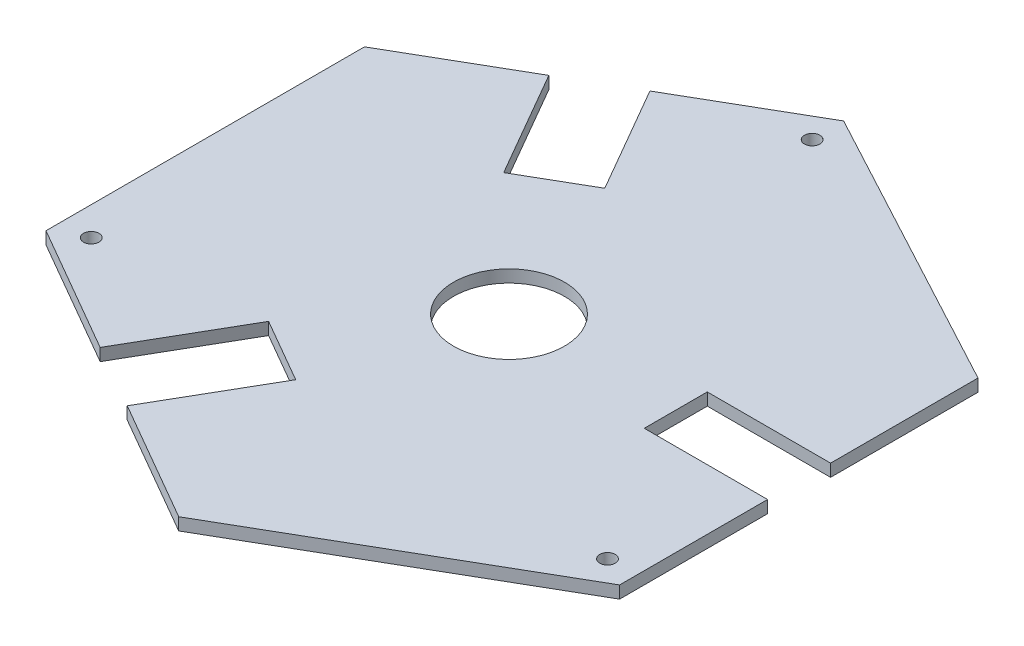
ISO-10303-21;
HEADER;
FILE_DESCRIPTION(('STEP AP214'),'2;1');
FILE_NAME('part.step','',(''),(''),'','','');
FILE_SCHEMA(('AUTOMOTIVE_DESIGN { 1 0 10303 214 1 1 1 1 }'));
ENDSEC;
DATA;
#1=APPLICATION_CONTEXT('core data for automotive mechanical design processes');
#2=APPLICATION_PROTOCOL_DEFINITION('international standard','automotive_design',2000,#1);
#3=PRODUCT_CONTEXT('',#1,'mechanical');
#4=PRODUCT('Part','Part','',(#3));
#5=PRODUCT_RELATED_PRODUCT_CATEGORY('part','',(#4));
#6=PRODUCT_DEFINITION_FORMATION('','',#4);
#7=PRODUCT_DEFINITION_CONTEXT('part definition',#1,'design');
#8=PRODUCT_DEFINITION('design','',#6,#7);
#9=PRODUCT_DEFINITION_SHAPE('','',#8);
#10=(LENGTH_UNIT() NAMED_UNIT(*) SI_UNIT(.MILLI.,.METRE.));
#11=(NAMED_UNIT(*) PLANE_ANGLE_UNIT() SI_UNIT($,.RADIAN.));
#12=(NAMED_UNIT(*) SI_UNIT($,.STERADIAN.) SOLID_ANGLE_UNIT());
#13=UNCERTAINTY_MEASURE_WITH_UNIT(LENGTH_MEASURE(1.E-05),#10,'distance_accuracy_value','');
#14=(GEOMETRIC_REPRESENTATION_CONTEXT(3) GLOBAL_UNCERTAINTY_ASSIGNED_CONTEXT((#13)) GLOBAL_UNIT_ASSIGNED_CONTEXT((#10,
#11,#12)) REPRESENTATION_CONTEXT('',''));
#15=CARTESIAN_POINT('',(0.,0.,0.));
#16=DIRECTION('',(0.,0.,1.));
#17=DIRECTION('',(1.,0.,0.));
#18=AXIS2_PLACEMENT_3D('',#15,#16,#17);
#19=CARTESIAN_POINT('',(0.,17.5,0.));
#20=DIRECTION('',(0.,-1.,0.));
#21=DIRECTION('',(0.,0.,-1.));
#22=AXIS2_PLACEMENT_3D('',#19,#20,#21);
#23=CYLINDRICAL_SURFACE('',#22,9.);
#24=CARTESIAN_POINT('',(0.,17.5,0.));
#25=DIRECTION('',(0.,1.,0.));
#26=DIRECTION('',(0.,0.,1.));
#27=AXIS2_PLACEMENT_3D('',#24,#25,#26);
#28=CIRCLE('',#27,9.);
#29=CARTESIAN_POINT('',(0.,17.5,9.));
#30=VERTEX_POINT('',#29);
#31=EDGE_CURVE('E362',#30,#30,#28,.T.);
#32=ORIENTED_EDGE('',*,*,#31,.T.);
#33=EDGE_LOOP('',(#32));
#34=FACE_BOUND('',#33,.T.);
#35=CARTESIAN_POINT('',(0.,15.5,0.));
#36=DIRECTION('',(0.,1.,0.));
#37=DIRECTION('',(0.,0.,1.));
#38=AXIS2_PLACEMENT_3D('',#35,#36,#37);
#39=CIRCLE('',#38,9.);
#40=CARTESIAN_POINT('',(0.,15.5,9.));
#41=VERTEX_POINT('',#40);
#42=EDGE_CURVE('E363',#41,#41,#39,.T.);
#43=ORIENTED_EDGE('',*,*,#42,.F.);
#44=EDGE_LOOP('',(#43));
#45=FACE_BOUND('',#44,.T.);
#46=ADVANCED_FACE('F41',(#34,#45),#23,.F.);
#47=CARTESIAN_POINT('',(0.0668776199884268,7.,-49.0942904802489));
#48=DIRECTION('',(0.,1.,0.));
#49=DIRECTION('',(0.,0.,1.));
#50=AXIS2_PLACEMENT_3D('',#47,#48,#49);
#51=CYLINDRICAL_SURFACE('',#50,1.25);
#52=CARTESIAN_POINT('',(0.0668776199884268,15.5,-49.0942904802489));
#53=DIRECTION('',(0.,1.,0.));
#54=DIRECTION('',(0.,0.,1.));
#55=AXIS2_PLACEMENT_3D('',#52,#53,#54);
#56=CIRCLE('',#55,1.25);
#57=CARTESIAN_POINT('',(0.0668776199884268,15.5,-47.8442904802489));
#58=VERTEX_POINT('',#57);
#59=EDGE_CURVE('E367',#58,#58,#56,.F.);
#60=ORIENTED_EDGE('',*,*,#59,.T.);
#61=EDGE_LOOP('',(#60));
#62=FACE_BOUND('',#61,.T.);
#63=CARTESIAN_POINT('',(0.0668776199884268,17.5,-49.0942904802489));
#64=DIRECTION('',(0.,1.,0.));
#65=DIRECTION('',(0.,0.,1.));
#66=AXIS2_PLACEMENT_3D('',#63,#64,#65);
#67=CIRCLE('',#66,1.25);
#68=CARTESIAN_POINT('',(0.0668776199884268,17.5,-47.8442904802489));
#69=VERTEX_POINT('',#68);
#70=EDGE_CURVE('E354',#69,#69,#67,.T.);
#71=ORIENTED_EDGE('',*,*,#70,.T.);
#72=EDGE_LOOP('',(#71));
#73=FACE_BOUND('',#72,.T.);
#74=ADVANCED_FACE('F418',(#62,#73),#51,.F.);
#75=CARTESIAN_POINT('',(-44.6151657788661,7.,23.1407684282072));
#76=DIRECTION('',(0.,1.,0.));
#77=DIRECTION('',(0.,0.,1.));
#78=AXIS2_PLACEMENT_3D('',#75,#76,#77);
#79=CYLINDRICAL_SURFACE('',#78,1.25);
#80=CARTESIAN_POINT('',(-44.6151657788661,15.5,23.1407684282072));
#81=DIRECTION('',(0.,1.,0.));
#82=DIRECTION('',(0.,0.,1.));
#83=AXIS2_PLACEMENT_3D('',#80,#81,#82);
#84=CIRCLE('',#83,1.25);
#85=CARTESIAN_POINT('',(-44.6151657788661,15.5,24.3907684282072));
#86=VERTEX_POINT('',#85);
#87=EDGE_CURVE('E378',#86,#86,#84,.F.);
#88=ORIENTED_EDGE('',*,*,#87,.T.);
#89=EDGE_LOOP('',(#88));
#90=FACE_BOUND('',#89,.T.);
#91=CARTESIAN_POINT('',(-44.6151657788661,17.5,23.1407684282072));
#92=DIRECTION('',(0.,1.,0.));
#93=DIRECTION('',(0.,0.,1.));
#94=AXIS2_PLACEMENT_3D('',#91,#92,#93);
#95=CIRCLE('',#94,1.25);
#96=CARTESIAN_POINT('',(-44.6151657788661,17.5,24.3907684282072));
#97=VERTEX_POINT('',#96);
#98=EDGE_CURVE('E297',#97,#97,#95,.T.);
#99=ORIENTED_EDGE('',*,*,#98,.T.);
#100=EDGE_LOOP('',(#99));
#101=FACE_BOUND('',#100,.T.);
#102=ADVANCED_FACE('F424',(#90,#101),#79,.F.);
#103=CARTESIAN_POINT('',(42.3480762113532,7.,26.3767752449313));
#104=DIRECTION('',(0.,1.,0.));
#105=DIRECTION('',(0.,0.,1.));
#106=AXIS2_PLACEMENT_3D('',#103,#104,#105);
#107=CYLINDRICAL_SURFACE('',#106,1.25);
#108=CARTESIAN_POINT('',(42.3480762113532,15.5,26.3767752449313));
#109=DIRECTION('',(0.,1.,0.));
#110=DIRECTION('',(0.,0.,1.));
#111=AXIS2_PLACEMENT_3D('',#108,#109,#110);
#112=CIRCLE('',#111,1.25);
#113=CARTESIAN_POINT('',(42.3480762113532,15.5,27.6267752449313));
#114=VERTEX_POINT('',#113);
#115=EDGE_CURVE('E374',#114,#114,#112,.F.);
#116=ORIENTED_EDGE('',*,*,#115,.T.);
#117=EDGE_LOOP('',(#116));
#118=FACE_BOUND('',#117,.T.);
#119=CARTESIAN_POINT('',(42.3480762113532,17.5,26.3767752449313));
#120=DIRECTION('',(0.,1.,0.));
#121=DIRECTION('',(0.,0.,1.));
#122=AXIS2_PLACEMENT_3D('',#119,#120,#121);
#123=CIRCLE('',#122,1.25);
#124=CARTESIAN_POINT('',(42.3480762113532,17.5,27.6267752449313));
#125=VERTEX_POINT('',#124);
#126=EDGE_CURVE('E358',#125,#125,#123,.T.);
#127=ORIENTED_EDGE('',*,*,#126,.T.);
#128=EDGE_LOOP('',(#127));
#129=FACE_BOUND('',#128,.T.);
#130=ADVANCED_FACE('F431',(#118,#129),#107,.F.);
#131=CARTESIAN_POINT('',(0.,17.5,0.));
#132=DIRECTION('',(0.,1.,0.));
#133=DIRECTION('',(0.,0.,1.));
#134=AXIS2_PLACEMENT_3D('',#131,#132,#133);
#135=PLANE('',#134);
#136=ORIENTED_EDGE('',*,*,#126,.F.);
#137=EDGE_LOOP('',(#136));
#138=FACE_BOUND('',#137,.T.);
#139=ORIENTED_EDGE('',*,*,#98,.F.);
#140=EDGE_LOOP('',(#139));
#141=FACE_BOUND('',#140,.T.);
#142=DIRECTION('',(0.866025403784439,0.,0.5));
#143=VECTOR('',#142,1.);
#144=CARTESIAN_POINT('',(-28.4824798766863,17.5,37.8265578798319));
#145=LINE('',#144,#143);
#146=CARTESIAN_POINT('',(-49.2670895675128,17.5,25.8265578798319));
#147=VERTEX_POINT('',#146);
#148=CARTESIAN_POINT('',(-28.4824798766863,17.5,37.8265578798319));
#149=VERTEX_POINT('',#148);
#150=EDGE_CURVE('E195',#147,#149,#145,.T.);
#151=ORIENTED_EDGE('',*,*,#150,.T.);
#152=DIRECTION('',(0.5,0.,-0.866025403784439));
#153=VECTOR('',#152,1.);
#154=CARTESIAN_POINT('',(-28.4824798766863,17.5,37.8265578798319));
#155=LINE('',#154,#153);
#156=CARTESIAN_POINT('',(-18.4824798766869,17.5,20.5060498041443));
#157=VERTEX_POINT('',#156);
#158=EDGE_CURVE('E346',#149,#157,#155,.T.);
#159=ORIENTED_EDGE('',*,*,#158,.T.);
#160=DIRECTION('',(0.866025403784439,0.,0.5));
#161=VECTOR('',#160,1.);
#162=CARTESIAN_POINT('',(-18.4824798766869,17.5,20.5060498041443));
#163=LINE('',#162,#161);
#164=CARTESIAN_POINT('',(-8.09017503127363,17.5,26.5060498041443));
#165=VERTEX_POINT('',#164);
#166=EDGE_CURVE('E343',#157,#165,#163,.T.);
#167=ORIENTED_EDGE('',*,*,#166,.T.);
#168=DIRECTION('',(-0.5,0.,0.866025403784439));
#169=VECTOR('',#168,1.);
#170=CARTESIAN_POINT('',(-8.09017503127363,17.5,26.5060498041443));
#171=LINE('',#170,#169);
#172=CARTESIAN_POINT('',(-18.090175031273,17.5,43.8265578798319));
#173=VERTEX_POINT('',#172);
#174=EDGE_CURVE('E340',#165,#173,#171,.T.);
#175=ORIENTED_EDGE('',*,*,#174,.T.);
#176=DIRECTION('',(0.866025403784439,0.,0.5));
#177=VECTOR('',#176,1.);
#178=CARTESIAN_POINT('',(-18.090175031273,17.5,43.8265578798319));
#179=LINE('',#178,#177);
#180=CARTESIAN_POINT('',(1.66891932634631,17.5,55.2344763261467));
#181=VERTEX_POINT('',#180);
#182=EDGE_CURVE('E337',#173,#181,#179,.T.);
#183=ORIENTED_EDGE('',*,*,#182,.T.);
#184=DIRECTION('',(0.866025403784438,0.,-0.5));
#185=VECTOR('',#184,1.);
#186=CARTESIAN_POINT('',(1.66891932634631,17.5,55.2344763261467));
#187=LINE('',#186,#185);
#188=CARTESIAN_POINT('',(47.,17.5,29.0625646965561));
#189=VERTEX_POINT('',#188);
#190=EDGE_CURVE('E334',#181,#189,#187,.T.);
#191=ORIENTED_EDGE('',*,*,#190,.T.);
#192=DIRECTION('',(0.,0.,-1.));
#193=VECTOR('',#192,1.);
#194=CARTESIAN_POINT('',(47.,17.5,5.06256469655606));
#195=LINE('',#194,#193);
#196=CARTESIAN_POINT('',(47.,17.5,5.06256469655606));
#197=VERTEX_POINT('',#196);
#198=EDGE_CURVE('E331',#189,#197,#195,.T.);
#199=ORIENTED_EDGE('',*,*,#198,.T.);
#200=DIRECTION('',(-1.,0.,0.));
#201=VECTOR('',#200,1.);
#202=CARTESIAN_POINT('',(26.9999999999999,17.5,5.06256469655606));
#203=LINE('',#202,#201);
#204=CARTESIAN_POINT('',(26.9999999999999,17.5,5.06256469655606));
#205=VERTEX_POINT('',#204);
#206=EDGE_CURVE('E328',#197,#205,#203,.T.);
#207=ORIENTED_EDGE('',*,*,#206,.T.);
#208=DIRECTION('',(0.,0.,-1.));
#209=VECTOR('',#208,1.);
#210=CARTESIAN_POINT('',(26.9999999999999,17.5,5.06256469655606));
#211=LINE('',#210,#209);
#212=CARTESIAN_POINT('',(26.9999999999999,17.5,-5.15470053837906));
#213=VERTEX_POINT('',#212);
#214=EDGE_CURVE('E325',#205,#213,#211,.T.);
#215=ORIENTED_EDGE('',*,*,#214,.T.);
#216=DIRECTION('',(1.,0.,0.));
#217=VECTOR('',#216,1.);
#218=CARTESIAN_POINT('',(26.9999999999999,17.5,-5.15470053837906));
#219=LINE('',#218,#217);
#220=CARTESIAN_POINT('',(47.,17.5,-5.15470053837906));
#221=VERTEX_POINT('',#220);
#222=EDGE_CURVE('E322',#213,#221,#219,.T.);
#223=ORIENTED_EDGE('',*,*,#222,.T.);
#224=DIRECTION('',(0.,0.,-1.));
#225=VECTOR('',#224,1.);
#226=CARTESIAN_POINT('',(47.,17.5,-5.15470053837906));
#227=LINE('',#226,#225);
#228=CARTESIAN_POINT('',(47.,17.5,-29.0625646965558));
#229=VERTEX_POINT('',#228);
#230=EDGE_CURVE('E319',#221,#229,#227,.T.);
#231=ORIENTED_EDGE('',*,*,#230,.T.);
#232=DIRECTION('',(-0.8812473665794,0.,-0.472655348956164));
#233=VECTOR('',#232,1.);
#234=CARTESIAN_POINT('',(47.,17.5,-29.0625646965558));
#235=LINE('',#234,#233);
#236=CARTESIAN_POINT('',(0.,17.5,-54.2709253038248));
#237=VERTEX_POINT('',#236);
#238=EDGE_CURVE('E316',#229,#237,#235,.T.);
#239=ORIENTED_EDGE('',*,*,#238,.T.);
#240=DIRECTION('',(-0.866025403784439,0.,0.5));
#241=VECTOR('',#240,1.);
#242=CARTESIAN_POINT('',(0.,17.5,-54.2709253038248));
#243=LINE('',#242,#241);
#244=CARTESIAN_POINT('',(-19.9185842870421,17.5,-42.7709253038248));
#245=VERTEX_POINT('',#244);
#246=EDGE_CURVE('E313',#237,#245,#243,.T.);
#247=ORIENTED_EDGE('',*,*,#246,.T.);
#248=DIRECTION('',(0.500000000000001,0.,0.866025403784438));
#249=VECTOR('',#248,1.);
#250=CARTESIAN_POINT('',(-19.9185842870421,17.5,-42.7709253038248));
#251=LINE('',#250,#249);
#252=CARTESIAN_POINT('',(-9.91858428704279,17.5,-25.4504172281373));
#253=VERTEX_POINT('',#252);
#254=EDGE_CURVE('E310',#245,#253,#251,.T.);
#255=ORIENTED_EDGE('',*,*,#254,.T.);
#256=DIRECTION('',(-0.866025403784439,0.,0.5));
#257=VECTOR('',#256,1.);
#258=CARTESIAN_POINT('',(-9.91858428704279,17.5,-25.4504172281373));
#259=LINE('',#258,#257);
#260=CARTESIAN_POINT('',(-20.3108891324561,17.5,-19.4504172281373));
#261=VERTEX_POINT('',#260);
#262=EDGE_CURVE('E307',#253,#261,#259,.T.);
#263=ORIENTED_EDGE('',*,*,#262,.T.);
#264=DIRECTION('',(-0.5,0.,-0.866025403784439));
#265=VECTOR('',#264,1.);
#266=CARTESIAN_POINT('',(-20.3108891324561,17.5,-19.4504172281373));
#267=LINE('',#266,#265);
#268=CARTESIAN_POINT('',(-30.3108891324553,17.5,-36.7709253038248));
#269=VERTEX_POINT('',#268);
#270=EDGE_CURVE('E304',#261,#269,#267,.T.);
#271=ORIENTED_EDGE('',*,*,#270,.T.);
#272=DIRECTION('',(-0.866025403784439,0.,0.5));
#273=VECTOR('',#272,1.);
#274=CARTESIAN_POINT('',(-30.3108891324553,17.5,-36.7709253038248));
#275=LINE('',#274,#273);
#276=CARTESIAN_POINT('',(-49.2670895675128,17.5,-25.8265578798319));
#277=VERTEX_POINT('',#276);
#278=EDGE_CURVE('E300',#269,#277,#275,.T.);
#279=ORIENTED_EDGE('',*,*,#278,.T.);
#280=DIRECTION('',(0.,0.,1.));
#281=VECTOR('',#280,1.);
#282=CARTESIAN_POINT('',(-49.2670895675128,17.5,-25.8265578798319));
#283=LINE('',#282,#281);
#284=EDGE_CURVE('E271',#277,#147,#283,.T.);
#285=ORIENTED_EDGE('',*,*,#284,.T.);
#286=EDGE_LOOP('',(#151,#159,#167,#175,#183,#191,#199,#207,#215,#223,#231,#239,#247,#255,#263,
#271,#279,#285));
#287=FACE_BOUND('',#286,.T.);
#288=ORIENTED_EDGE('',*,*,#70,.F.);
#289=EDGE_LOOP('',(#288));
#290=FACE_BOUND('',#289,.T.);
#291=ORIENTED_EDGE('',*,*,#31,.F.);
#292=EDGE_LOOP('',(#291));
#293=FACE_BOUND('',#292,.T.);
#294=ADVANCED_FACE('F401',(#138,#141,#287,#290,#293),#135,.T.);
#295=CARTESIAN_POINT('',(-49.2670895675128,-4.5,-23.5171568030734));
#296=DIRECTION('',(1.,0.,0.));
#297=DIRECTION('',(0.,0.,-1.));
#298=AXIS2_PLACEMENT_3D('',#295,#296,#297);
#299=PLANE('',#298);
#300=DIRECTION('',(0.,1.,0.));
#301=VECTOR('',#300,1.);
#302=CARTESIAN_POINT('',(-49.2670895675128,-4.5,-25.8265578798319));
#303=LINE('',#302,#301);
#304=CARTESIAN_POINT('',(-49.2670895675128,15.5,-25.8265578798319));
#305=VERTEX_POINT('',#304);
#306=EDGE_CURVE('E188',#305,#277,#303,.T.);
#307=ORIENTED_EDGE('',*,*,#306,.F.);
#308=DIRECTION('',(0.,0.,-1.));
#309=VECTOR('',#308,1.);
#310=CARTESIAN_POINT('',(-49.2670895675128,15.5,-25.8265578798319));
#311=LINE('',#310,#309);
#312=CARTESIAN_POINT('',(-49.2670895675128,15.5,25.8265578798319));
#313=VERTEX_POINT('',#312);
#314=EDGE_CURVE('E172',#313,#305,#311,.T.);
#315=ORIENTED_EDGE('',*,*,#314,.F.);
#316=DIRECTION('',(0.,1.,0.));
#317=VECTOR('',#316,1.);
#318=CARTESIAN_POINT('',(-49.2670895675128,-4.5,25.8265578798319));
#319=LINE('',#318,#317);
#320=EDGE_CURVE('E51',#313,#147,#319,.T.);
#321=ORIENTED_EDGE('',*,*,#320,.T.);
#322=ORIENTED_EDGE('',*,*,#284,.F.);
#323=EDGE_LOOP('',(#307,#315,#321,#322));
#324=FACE_BOUND('',#323,.T.);
#325=ADVANCED_FACE('F185',(#324),#299,.F.);
#326=CARTESIAN_POINT('',(47.,17.5,-29.0625646965558));
#327=DIRECTION('',(-0.472655348956164,0.,0.8812473665794));
#328=DIRECTION('',(0.8812473665794,0.,0.472655348956164));
#329=AXIS2_PLACEMENT_3D('',#326,#327,#328);
#330=PLANE('',#329);
#331=DIRECTION('',(-0.8812473665794,0.,-0.472655348956164));
#332=VECTOR('',#331,1.);
#333=CARTESIAN_POINT('',(47.,15.5,-29.0625646965558));
#334=LINE('',#333,#332);
#335=CARTESIAN_POINT('',(47.,15.5,-29.0625646965558));
#336=VERTEX_POINT('',#335);
#337=CARTESIAN_POINT('',(0.,15.5,-54.2709253038248));
#338=VERTEX_POINT('',#337);
#339=EDGE_CURVE('E11',#336,#338,#334,.T.);
#340=ORIENTED_EDGE('',*,*,#339,.T.);
#341=DIRECTION('',(0.,-1.,0.));
#342=VECTOR('',#341,1.);
#343=CARTESIAN_POINT('',(0.,17.5,-54.2709253038248));
#344=LINE('',#343,#342);
#345=EDGE_CURVE('E252',#237,#338,#344,.T.);
#346=ORIENTED_EDGE('',*,*,#345,.F.);
#347=ORIENTED_EDGE('',*,*,#238,.F.);
#348=DIRECTION('',(0.,-1.,0.));
#349=VECTOR('',#348,1.);
#350=CARTESIAN_POINT('',(47.,17.5,-29.0625646965558));
#351=LINE('',#350,#349);
#352=EDGE_CURVE('E249',#229,#336,#351,.T.);
#353=ORIENTED_EDGE('',*,*,#352,.T.);
#354=EDGE_LOOP('',(#340,#346,#347,#353));
#355=FACE_BOUND('',#354,.T.);
#356=ADVANCED_FACE('F438',(#355),#330,.F.);
#357=CARTESIAN_POINT('',(-20.3108891324561,17.5,-19.4504172281373));
#358=DIRECTION('',(-0.866025403784439,0.,0.5));
#359=DIRECTION('',(0.5,0.,0.866025403784439));
#360=AXIS2_PLACEMENT_3D('',#357,#358,#359);
#361=PLANE('',#360);
#362=DIRECTION('',(-0.5,0.,-0.866025403784439));
#363=VECTOR('',#362,1.);
#364=CARTESIAN_POINT('',(-20.3108891324561,15.5,-19.4504172281373));
#365=LINE('',#364,#363);
#366=CARTESIAN_POINT('',(-20.3108891324561,15.5,-19.4504172281373));
#367=VERTEX_POINT('',#366);
#368=CARTESIAN_POINT('',(-30.3108891324554,15.5,-36.7709253038248));
#369=VERTEX_POINT('',#368);
#370=EDGE_CURVE('E65',#367,#369,#365,.T.);
#371=ORIENTED_EDGE('',*,*,#370,.T.);
#372=DIRECTION('',(0.,-1.,0.));
#373=VECTOR('',#372,1.);
#374=CARTESIAN_POINT('',(-30.3108891324553,17.5,-36.7709253038248));
#375=LINE('',#374,#373);
#376=EDGE_CURVE('E267',#269,#369,#375,.T.);
#377=ORIENTED_EDGE('',*,*,#376,.F.);
#378=ORIENTED_EDGE('',*,*,#270,.F.);
#379=DIRECTION('',(0.,-1.,0.));
#380=VECTOR('',#379,1.);
#381=CARTESIAN_POINT('',(-20.3108891324561,17.5,-19.4504172281373));
#382=LINE('',#381,#380);
#383=EDGE_CURVE('E264',#261,#367,#382,.T.);
#384=ORIENTED_EDGE('',*,*,#383,.T.);
#385=EDGE_LOOP('',(#371,#377,#378,#384));
#386=FACE_BOUND('',#385,.T.);
#387=ADVANCED_FACE('F435',(#386),#361,.F.);
#388=CARTESIAN_POINT('',(0.,15.5,0.));
#389=DIRECTION('',(0.,1.,0.));
#390=DIRECTION('',(0.,0.,1.));
#391=AXIS2_PLACEMENT_3D('',#388,#389,#390);
#392=PLANE('',#391);
#393=DIRECTION('',(0.866025403784439,0.,-0.5));
#394=VECTOR('',#393,1.);
#395=CARTESIAN_POINT('',(0.,15.5,-54.2709253038248));
#396=LINE('',#395,#394);
#397=EDGE_CURVE('E389',#305,#369,#396,.T.);
#398=ORIENTED_EDGE('',*,*,#397,.T.);
#399=ORIENTED_EDGE('',*,*,#370,.F.);
#400=DIRECTION('',(-0.866025403784439,0.,0.5));
#401=VECTOR('',#400,1.);
#402=CARTESIAN_POINT('',(-9.91858428704279,15.5,-25.4504172281373));
#403=LINE('',#402,#401);
#404=CARTESIAN_POINT('',(-9.91858428704279,15.5,-25.4504172281373));
#405=VERTEX_POINT('',#404);
#406=EDGE_CURVE('E274',#405,#367,#403,.T.);
#407=ORIENTED_EDGE('',*,*,#406,.F.);
#408=DIRECTION('',(0.500000000000001,0.,0.866025403784438));
#409=VECTOR('',#408,1.);
#410=CARTESIAN_POINT('',(-19.9185842870421,15.5,-42.7709253038248));
#411=LINE('',#410,#409);
#412=CARTESIAN_POINT('',(-19.9185842870421,15.5,-42.7709253038248));
#413=VERTEX_POINT('',#412);
#414=EDGE_CURVE('E277',#413,#405,#411,.T.);
#415=ORIENTED_EDGE('',*,*,#414,.F.);
#416=EDGE_CURVE('E190',#413,#338,#396,.T.);
#417=ORIENTED_EDGE('',*,*,#416,.T.);
#418=ORIENTED_EDGE('',*,*,#339,.F.);
#419=DIRECTION('',(0.,0.,1.));
#420=VECTOR('',#419,1.);
#421=CARTESIAN_POINT('',(47.,15.5,29.0625646965561));
#422=LINE('',#421,#420);
#423=CARTESIAN_POINT('',(47.,15.5,-5.15470053837906));
#424=VERTEX_POINT('',#423);
#425=EDGE_CURVE('E385',#336,#424,#422,.T.);
#426=ORIENTED_EDGE('',*,*,#425,.T.);
#427=DIRECTION('',(1.,0.,0.));
#428=VECTOR('',#427,1.);
#429=CARTESIAN_POINT('',(26.9999999999999,15.5,-5.15470053837906));
#430=LINE('',#429,#428);
#431=CARTESIAN_POINT('',(26.9999999999999,15.5,-5.15470053837906));
#432=VERTEX_POINT('',#431);
#433=EDGE_CURVE('E279',#432,#424,#430,.T.);
#434=ORIENTED_EDGE('',*,*,#433,.F.);
#435=DIRECTION('',(0.,0.,-1.));
#436=VECTOR('',#435,1.);
#437=CARTESIAN_POINT('',(26.9999999999999,15.5,5.06256469655606));
#438=LINE('',#437,#436);
#439=CARTESIAN_POINT('',(26.9999999999999,15.5,5.06256469655606));
#440=VERTEX_POINT('',#439);
#441=EDGE_CURVE('E283',#440,#432,#438,.T.);
#442=ORIENTED_EDGE('',*,*,#441,.F.);
#443=DIRECTION('',(-1.,0.,0.));
#444=VECTOR('',#443,1.);
#445=CARTESIAN_POINT('',(26.9999999999999,15.5,5.06256469655606));
#446=LINE('',#445,#444);
#447=CARTESIAN_POINT('',(47.,15.5,5.06256469655606));
#448=VERTEX_POINT('',#447);
#449=EDGE_CURVE('E286',#448,#440,#446,.T.);
#450=ORIENTED_EDGE('',*,*,#449,.F.);
#451=CARTESIAN_POINT('',(47.,15.5,29.0625646965561));
#452=VERTEX_POINT('',#451);
#453=EDGE_CURVE('E388',#448,#452,#422,.T.);
#454=ORIENTED_EDGE('',*,*,#453,.T.);
#455=DIRECTION('',(-0.866025403784438,0.,0.5));
#456=VECTOR('',#455,1.);
#457=CARTESIAN_POINT('',(1.66891932634631,15.5,55.2344763261467));
#458=LINE('',#457,#456);
#459=CARTESIAN_POINT('',(1.66891932634631,15.5,55.2344763261467));
#460=VERTEX_POINT('',#459);
#461=EDGE_CURVE('E382',#452,#460,#458,.T.);
#462=ORIENTED_EDGE('',*,*,#461,.T.);
#463=DIRECTION('',(-0.866025403784439,0.,-0.5));
#464=VECTOR('',#463,1.);
#465=CARTESIAN_POINT('',(-49.2670895675128,15.5,25.8265578798319));
#466=LINE('',#465,#464);
#467=CARTESIAN_POINT('',(-18.090175031273,15.5,43.8265578798319));
#468=VERTEX_POINT('',#467);
#469=EDGE_CURVE('E181',#460,#468,#466,.T.);
#470=ORIENTED_EDGE('',*,*,#469,.T.);
#471=DIRECTION('',(-0.5,0.,0.866025403784439));
#472=VECTOR('',#471,1.);
#473=CARTESIAN_POINT('',(-8.09017503127363,15.5,26.5060498041443));
#474=LINE('',#473,#472);
#475=CARTESIAN_POINT('',(-8.09017503127362,15.5,26.5060498041443));
#476=VERTEX_POINT('',#475);
#477=EDGE_CURVE('E289',#476,#468,#474,.T.);
#478=ORIENTED_EDGE('',*,*,#477,.F.);
#479=DIRECTION('',(0.866025403784439,0.,0.5));
#480=VECTOR('',#479,1.);
#481=CARTESIAN_POINT('',(-18.4824798766869,15.5,20.5060498041443));
#482=LINE('',#481,#480);
#483=CARTESIAN_POINT('',(-18.4824798766869,15.5,20.5060498041443));
#484=VERTEX_POINT('',#483);
#485=EDGE_CURVE('E292',#484,#476,#482,.T.);
#486=ORIENTED_EDGE('',*,*,#485,.F.);
#487=DIRECTION('',(0.5,0.,-0.866025403784439));
#488=VECTOR('',#487,1.);
#489=CARTESIAN_POINT('',(-28.4824798766863,15.5,37.8265578798319));
#490=LINE('',#489,#488);
#491=CARTESIAN_POINT('',(-28.4824798766863,15.5,37.8265578798319));
#492=VERTEX_POINT('',#491);
#493=EDGE_CURVE('E175',#492,#484,#490,.T.);
#494=ORIENTED_EDGE('',*,*,#493,.F.);
#495=EDGE_CURVE('E168',#492,#313,#466,.T.);
#496=ORIENTED_EDGE('',*,*,#495,.T.);
#497=ORIENTED_EDGE('',*,*,#314,.T.);
#498=EDGE_LOOP('',(#398,#399,#407,#415,#417,#418,#426,#434,#442,#450,#454,#462,#470,#478,#486,
#494,#496,#497));
#499=FACE_BOUND('',#498,.T.);
#500=ORIENTED_EDGE('',*,*,#42,.T.);
#501=EDGE_LOOP('',(#500));
#502=FACE_BOUND('',#501,.T.);
#503=ORIENTED_EDGE('',*,*,#115,.F.);
#504=EDGE_LOOP('',(#503));
#505=FACE_BOUND('',#504,.T.);
#506=ORIENTED_EDGE('',*,*,#59,.F.);
#507=EDGE_LOOP('',(#506));
#508=FACE_BOUND('',#507,.T.);
#509=ORIENTED_EDGE('',*,*,#87,.F.);
#510=EDGE_LOOP('',(#509));
#511=FACE_BOUND('',#510,.T.);
#512=ADVANCED_FACE('F170',(#499,#502,#505,#508,#511),#392,.F.);
#513=CARTESIAN_POINT('',(26.9999999999999,17.5,-5.15470053837906));
#514=DIRECTION('',(0.,0.,-1.));
#515=DIRECTION('',(-1.,0.,0.));
#516=AXIS2_PLACEMENT_3D('',#513,#514,#515);
#517=PLANE('',#516);
#518=ORIENTED_EDGE('',*,*,#433,.T.);
#519=DIRECTION('',(0.,-1.,0.));
#520=VECTOR('',#519,1.);
#521=CARTESIAN_POINT('',(47.,17.5,-5.15470053837906));
#522=LINE('',#521,#520);
#523=EDGE_CURVE('E245',#221,#424,#522,.T.);
#524=ORIENTED_EDGE('',*,*,#523,.F.);
#525=ORIENTED_EDGE('',*,*,#222,.F.);
#526=DIRECTION('',(0.,-1.,0.));
#527=VECTOR('',#526,1.);
#528=CARTESIAN_POINT('',(26.9999999999999,17.5,-5.15470053837906));
#529=LINE('',#528,#527);
#530=EDGE_CURVE('E241',#213,#432,#529,.T.);
#531=ORIENTED_EDGE('',*,*,#530,.T.);
#532=EDGE_LOOP('',(#518,#524,#525,#531));
#533=FACE_BOUND('',#532,.T.);
#534=ADVANCED_FACE('F414',(#533),#517,.F.);
#535=CARTESIAN_POINT('',(-8.09017503127363,17.5,26.5060498041443));
#536=DIRECTION('',(0.866025403784439,0.,0.5));
#537=DIRECTION('',(0.5,0.,-0.866025403784439));
#538=AXIS2_PLACEMENT_3D('',#535,#536,#537);
#539=PLANE('',#538);
#540=ORIENTED_EDGE('',*,*,#477,.T.);
#541=DIRECTION('',(0.,-1.,0.));
#542=VECTOR('',#541,1.);
#543=CARTESIAN_POINT('',(-18.090175031273,17.5,43.8265578798319));
#544=LINE('',#543,#542);
#545=EDGE_CURVE('E227',#173,#468,#544,.T.);
#546=ORIENTED_EDGE('',*,*,#545,.F.);
#547=ORIENTED_EDGE('',*,*,#174,.F.);
#548=DIRECTION('',(0.,-1.,0.));
#549=VECTOR('',#548,1.);
#550=CARTESIAN_POINT('',(-8.09017503127363,17.5,26.5060498041443));
#551=LINE('',#550,#549);
#552=EDGE_CURVE('E221',#165,#476,#551,.T.);
#553=ORIENTED_EDGE('',*,*,#552,.T.);
#554=EDGE_LOOP('',(#540,#546,#547,#553));
#555=FACE_BOUND('',#554,.T.);
#556=ADVANCED_FACE('F397',(#555),#539,.F.);
#557=CARTESIAN_POINT('',(-28.4824798766863,17.5,37.8265578798319));
#558=DIRECTION('',(-0.866025403784439,0.,-0.5));
#559=DIRECTION('',(-0.5,0.,0.866025403784439));
#560=AXIS2_PLACEMENT_3D('',#557,#558,#559);
#561=PLANE('',#560);
#562=ORIENTED_EDGE('',*,*,#493,.T.);
#563=DIRECTION('',(0.,-1.,0.));
#564=VECTOR('',#563,1.);
#565=CARTESIAN_POINT('',(-18.4824798766869,17.5,20.5060498041443));
#566=LINE('',#565,#564);
#567=EDGE_CURVE('E217',#157,#484,#566,.T.);
#568=ORIENTED_EDGE('',*,*,#567,.F.);
#569=ORIENTED_EDGE('',*,*,#158,.F.);
#570=DIRECTION('',(0.,-1.,0.));
#571=VECTOR('',#570,1.);
#572=CARTESIAN_POINT('',(-28.4824798766863,17.5,37.8265578798319));
#573=LINE('',#572,#571);
#574=EDGE_CURVE('E202',#149,#492,#573,.T.);
#575=ORIENTED_EDGE('',*,*,#574,.T.);
#576=EDGE_LOOP('',(#562,#568,#569,#575));
#577=FACE_BOUND('',#576,.T.);
#578=ADVANCED_FACE('F403',(#577),#561,.F.);
#579=CARTESIAN_POINT('',(26.9999999999999,17.5,5.06256469655606));
#580=DIRECTION('',(0.,0.,1.));
#581=DIRECTION('',(1.,0.,0.));
#582=AXIS2_PLACEMENT_3D('',#579,#580,#581);
#583=PLANE('',#582);
#584=ORIENTED_EDGE('',*,*,#449,.T.);
#585=DIRECTION('',(0.,-1.,0.));
#586=VECTOR('',#585,1.);
#587=CARTESIAN_POINT('',(26.9999999999999,17.5,5.06256469655606));
#588=LINE('',#587,#586);
#589=EDGE_CURVE('E237',#205,#440,#588,.T.);
#590=ORIENTED_EDGE('',*,*,#589,.F.);
#591=ORIENTED_EDGE('',*,*,#206,.F.);
#592=DIRECTION('',(0.,-1.,0.));
#593=VECTOR('',#592,1.);
#594=CARTESIAN_POINT('',(47.,17.5,5.06256469655606));
#595=LINE('',#594,#593);
#596=EDGE_CURVE('E233',#197,#448,#595,.T.);
#597=ORIENTED_EDGE('',*,*,#596,.T.);
#598=EDGE_LOOP('',(#584,#590,#591,#597));
#599=FACE_BOUND('',#598,.T.);
#600=ADVANCED_FACE('F405',(#599),#583,.F.);
#601=CARTESIAN_POINT('',(-19.9185842870421,17.5,-42.7709253038248));
#602=DIRECTION('',(0.866025403784438,0.,-0.500000000000001));
#603=DIRECTION('',(-0.500000000000001,0.,-0.866025403784438));
#604=AXIS2_PLACEMENT_3D('',#601,#602,#603);
#605=PLANE('',#604);
#606=ORIENTED_EDGE('',*,*,#414,.T.);
#607=DIRECTION('',(0.,-1.,0.));
#608=VECTOR('',#607,1.);
#609=CARTESIAN_POINT('',(-9.91858428704279,17.5,-25.4504172281373));
#610=LINE('',#609,#608);
#611=EDGE_CURVE('E260',#253,#405,#610,.T.);
#612=ORIENTED_EDGE('',*,*,#611,.F.);
#613=ORIENTED_EDGE('',*,*,#254,.F.);
#614=DIRECTION('',(0.,-1.,0.));
#615=VECTOR('',#614,1.);
#616=CARTESIAN_POINT('',(-19.9185842870421,17.5,-42.7709253038248));
#617=LINE('',#616,#615);
#618=EDGE_CURVE('E256',#245,#413,#617,.T.);
#619=ORIENTED_EDGE('',*,*,#618,.T.);
#620=EDGE_LOOP('',(#606,#612,#613,#619));
#621=FACE_BOUND('',#620,.T.);
#622=ADVANCED_FACE('F411',(#621),#605,.F.);
#623=CARTESIAN_POINT('',(-6.38363955691262,2.,27.4913185196482));
#624=DIRECTION('',(0.499999999999999,0.,-0.866025403784439));
#625=DIRECTION('',(-0.866025403784439,0.,-0.499999999999999));
#626=AXIS2_PLACEMENT_3D('',#623,#624,#625);
#627=PLANE('',#626);
#628=ORIENTED_EDGE('',*,*,#485,.T.);
#629=ORIENTED_EDGE('',*,*,#552,.F.);
#630=ORIENTED_EDGE('',*,*,#166,.F.);
#631=ORIENTED_EDGE('',*,*,#567,.T.);
#632=EDGE_LOOP('',(#628,#629,#630,#631));
#633=FACE_BOUND('',#632,.T.);
#634=ADVANCED_FACE('F399',(#633),#627,.F.);
#635=CARTESIAN_POINT('',(26.9999999999999,2.,-8.21726523493512));
#636=DIRECTION('',(-1.,0.,0.));
#637=DIRECTION('',(0.,0.,1.));
#638=AXIS2_PLACEMENT_3D('',#635,#636,#637);
#639=PLANE('',#638);
#640=ORIENTED_EDGE('',*,*,#441,.T.);
#641=ORIENTED_EDGE('',*,*,#530,.F.);
#642=ORIENTED_EDGE('',*,*,#214,.F.);
#643=ORIENTED_EDGE('',*,*,#589,.T.);
#644=EDGE_LOOP('',(#640,#641,#642,#643));
#645=FACE_BOUND('',#644,.T.);
#646=ADVANCED_FACE('F465',(#645),#639,.F.);
#647=CARTESIAN_POINT('',(-20.616360443089,2.,-19.2740532847137));
#648=DIRECTION('',(0.500000000000001,0.,0.866025403784438));
#649=DIRECTION('',(0.866025403784438,0.,-0.500000000000001));
#650=AXIS2_PLACEMENT_3D('',#647,#648,#649);
#651=PLANE('',#650);
#652=ORIENTED_EDGE('',*,*,#406,.T.);
#653=ORIENTED_EDGE('',*,*,#383,.F.);
#654=ORIENTED_EDGE('',*,*,#262,.F.);
#655=ORIENTED_EDGE('',*,*,#611,.T.);
#656=EDGE_LOOP('',(#652,#653,#654,#655));
#657=FACE_BOUND('',#656,.T.);
#658=ADVANCED_FACE('F484',(#657),#651,.F.);
#659=CARTESIAN_POINT('',(47.,-8.5,-46.1880215351701));
#660=DIRECTION('',(-1.,0.,0.));
#661=DIRECTION('',(0.,0.,1.));
#662=AXIS2_PLACEMENT_3D('',#659,#660,#661);
#663=PLANE('',#662);
#664=ORIENTED_EDGE('',*,*,#523,.T.);
#665=ORIENTED_EDGE('',*,*,#425,.F.);
#666=ORIENTED_EDGE('',*,*,#352,.F.);
#667=ORIENTED_EDGE('',*,*,#230,.F.);
#668=EDGE_LOOP('',(#664,#665,#666,#667));
#669=FACE_BOUND('',#668,.T.);
#670=ADVANCED_FACE('F458',(#669),#663,.F.);
#671=CARTESIAN_POINT('',(3.66891932634631,-4.5,54.0797757877674));
#672=DIRECTION('',(-0.5,0.,-0.866025403784439));
#673=DIRECTION('',(-0.866025403784439,0.,0.5));
#674=AXIS2_PLACEMENT_3D('',#671,#672,#673);
#675=PLANE('',#674);
#676=DIRECTION('',(0.,1.,0.));
#677=VECTOR('',#676,1.);
#678=CARTESIAN_POINT('',(1.66891932634631,-4.5,55.2344763261467));
#679=LINE('',#678,#677);
#680=EDGE_CURVE('E45',#460,#181,#679,.T.);
#681=ORIENTED_EDGE('',*,*,#680,.F.);
#682=ORIENTED_EDGE('',*,*,#461,.F.);
#683=DIRECTION('',(0.,1.,0.));
#684=VECTOR('',#683,1.);
#685=CARTESIAN_POINT('',(47.,-4.5,29.0625646965561));
#686=LINE('',#685,#684);
#687=EDGE_CURVE('E199',#452,#189,#686,.T.);
#688=ORIENTED_EDGE('',*,*,#687,.T.);
#689=ORIENTED_EDGE('',*,*,#190,.F.);
#690=EDGE_LOOP('',(#681,#682,#688,#689));
#691=FACE_BOUND('',#690,.T.);
#692=ADVANCED_FACE('F495',(#691),#675,.F.);
#693=ORIENTED_EDGE('',*,*,#687,.F.);
#694=ORIENTED_EDGE('',*,*,#453,.F.);
#695=ORIENTED_EDGE('',*,*,#596,.F.);
#696=ORIENTED_EDGE('',*,*,#198,.F.);
#697=EDGE_LOOP('',(#693,#694,#695,#696));
#698=FACE_BOUND('',#697,.T.);
#699=ADVANCED_FACE('F469',(#698),#663,.F.);
#700=CARTESIAN_POINT('',(16.5,-8.5,-63.7972047454537));
#701=DIRECTION('',(0.5,0.,0.866025403784439));
#702=DIRECTION('',(0.866025403784439,0.,-0.5));
#703=AXIS2_PLACEMENT_3D('',#700,#701,#702);
#704=PLANE('',#703);
#705=ORIENTED_EDGE('',*,*,#376,.T.);
#706=ORIENTED_EDGE('',*,*,#397,.F.);
#707=ORIENTED_EDGE('',*,*,#306,.T.);
#708=ORIENTED_EDGE('',*,*,#278,.F.);
#709=EDGE_LOOP('',(#705,#706,#707,#708));
#710=FACE_BOUND('',#709,.T.);
#711=ADVANCED_FACE('F488',(#710),#704,.F.);
#712=ORIENTED_EDGE('',*,*,#345,.T.);
#713=ORIENTED_EDGE('',*,*,#416,.F.);
#714=ORIENTED_EDGE('',*,*,#618,.F.);
#715=ORIENTED_EDGE('',*,*,#246,.F.);
#716=EDGE_LOOP('',(#712,#713,#714,#715));
#717=FACE_BOUND('',#716,.T.);
#718=ADVANCED_FACE('F478',(#717),#704,.F.);
#719=CARTESIAN_POINT('',(16.5,-8.5,63.7972047454537));
#720=DIRECTION('',(0.5,0.,-0.866025403784439));
#721=DIRECTION('',(-0.866025403784439,0.,-0.5));
#722=AXIS2_PLACEMENT_3D('',#719,#720,#721);
#723=PLANE('',#722);
#724=ORIENTED_EDGE('',*,*,#545,.T.);
#725=ORIENTED_EDGE('',*,*,#469,.F.);
#726=ORIENTED_EDGE('',*,*,#680,.T.);
#727=ORIENTED_EDGE('',*,*,#182,.F.);
#728=EDGE_LOOP('',(#724,#725,#726,#727));
#729=FACE_BOUND('',#728,.T.);
#730=ADVANCED_FACE('F43',(#729),#723,.F.);
#731=ORIENTED_EDGE('',*,*,#320,.F.);
#732=ORIENTED_EDGE('',*,*,#495,.F.);
#733=ORIENTED_EDGE('',*,*,#574,.F.);
#734=ORIENTED_EDGE('',*,*,#150,.F.);
#735=EDGE_LOOP('',(#731,#732,#733,#734));
#736=FACE_BOUND('',#735,.T.);
#737=ADVANCED_FACE('F193',(#736),#723,.F.);
#738=CLOSED_SHELL('',(#46,#74,#102,#130,#294,#325,#356,#387,#512,#534,#556,#578,#600,#622,#634,
#646,#658,#670,#692,#699,#711,#718,#730,#737));
#739=MANIFOLD_SOLID_BREP('B2',#738);
#740=ADVANCED_BREP_SHAPE_REPRESENTATION('',(#18,#739),#14);
#741=SHAPE_DEFINITION_REPRESENTATION(#9,#740);
ENDSEC;
END-ISO-10303-21;
